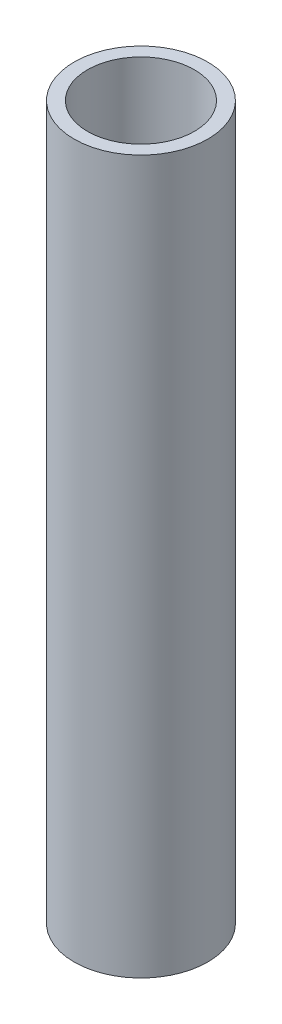
ISO-10303-21;
HEADER;
FILE_DESCRIPTION(('STEP AP214'),'2;1');
FILE_NAME('part.step','',(''),(''),'','','');
FILE_SCHEMA(('AUTOMOTIVE_DESIGN { 1 0 10303 214 1 1 1 1 }'));
ENDSEC;
DATA;
#1=APPLICATION_CONTEXT('core data for automotive mechanical design processes');
#2=APPLICATION_PROTOCOL_DEFINITION('international standard','automotive_design',2000,#1);
#3=PRODUCT_CONTEXT('',#1,'mechanical');
#4=PRODUCT('Part','Part','',(#3));
#5=PRODUCT_RELATED_PRODUCT_CATEGORY('part','',(#4));
#6=PRODUCT_DEFINITION_FORMATION('','',#4);
#7=PRODUCT_DEFINITION_CONTEXT('part definition',#1,'design');
#8=PRODUCT_DEFINITION('design','',#6,#7);
#9=PRODUCT_DEFINITION_SHAPE('','',#8);
#10=(LENGTH_UNIT() NAMED_UNIT(*) SI_UNIT(.MILLI.,.METRE.));
#11=(NAMED_UNIT(*) PLANE_ANGLE_UNIT() SI_UNIT($,.RADIAN.));
#12=(NAMED_UNIT(*) SI_UNIT($,.STERADIAN.) SOLID_ANGLE_UNIT());
#13=UNCERTAINTY_MEASURE_WITH_UNIT(LENGTH_MEASURE(1.E-05),#10,'distance_accuracy_value','');
#14=(GEOMETRIC_REPRESENTATION_CONTEXT(3) GLOBAL_UNCERTAINTY_ASSIGNED_CONTEXT((#13)) GLOBAL_UNIT_ASSIGNED_CONTEXT((#10,
#11,#12)) REPRESENTATION_CONTEXT('',''));
#15=CARTESIAN_POINT('',(0.,0.,0.));
#16=DIRECTION('',(0.,0.,1.));
#17=DIRECTION('',(1.,0.,0.));
#18=AXIS2_PLACEMENT_3D('',#15,#16,#17);
#19=CARTESIAN_POINT('',(0.,50.8,0.));
#20=DIRECTION('',(0.,1.,0.));
#21=DIRECTION('',(0.,0.,1.));
#22=AXIS2_PLACEMENT_3D('',#19,#20,#21);
#23=PLANE('',#22);
#24=CARTESIAN_POINT('',(0.,50.8,0.));
#25=DIRECTION('',(0.,1.,0.));
#26=DIRECTION('',(0.,0.,1.));
#27=AXIS2_PLACEMENT_3D('',#24,#25,#26);
#28=CIRCLE('',#27,4.7625);
#29=CARTESIAN_POINT('',(0.,50.8,4.7625));
#30=VERTEX_POINT('',#29);
#31=EDGE_CURVE('E10',#30,#30,#28,.T.);
#32=ORIENTED_EDGE('',*,*,#31,.T.);
#33=EDGE_LOOP('',(#32));
#34=FACE_BOUND('',#33,.T.);
#35=CARTESIAN_POINT('',(0.,50.8,0.));
#36=DIRECTION('',(0.,1.,0.));
#37=DIRECTION('',(0.,0.,1.));
#38=AXIS2_PLACEMENT_3D('',#35,#36,#37);
#39=CIRCLE('',#38,3.81);
#40=CARTESIAN_POINT('',(0.,50.8,3.81));
#41=VERTEX_POINT('',#40);
#42=EDGE_CURVE('E42',#41,#41,#39,.T.);
#43=ORIENTED_EDGE('',*,*,#42,.F.);
#44=EDGE_LOOP('',(#43));
#45=FACE_BOUND('',#44,.T.);
#46=ADVANCED_FACE('F31',(#34,#45),#23,.T.);
#47=CARTESIAN_POINT('',(0.,0.,0.));
#48=DIRECTION('',(0.,1.,0.));
#49=DIRECTION('',(0.,0.,1.));
#50=AXIS2_PLACEMENT_3D('',#47,#48,#49);
#51=PLANE('',#50);
#52=CARTESIAN_POINT('',(0.,0.,0.));
#53=DIRECTION('',(0.,1.,0.));
#54=DIRECTION('',(0.,0.,1.));
#55=AXIS2_PLACEMENT_3D('',#52,#53,#54);
#56=CIRCLE('',#55,4.7625);
#57=CARTESIAN_POINT('',(0.,0.,4.7625));
#58=VERTEX_POINT('',#57);
#59=EDGE_CURVE('E35',#58,#58,#56,.T.);
#60=ORIENTED_EDGE('',*,*,#59,.F.);
#61=EDGE_LOOP('',(#60));
#62=FACE_BOUND('',#61,.T.);
#63=CARTESIAN_POINT('',(0.,0.,0.));
#64=DIRECTION('',(0.,1.,0.));
#65=DIRECTION('',(0.,0.,1.));
#66=AXIS2_PLACEMENT_3D('',#63,#64,#65);
#67=CIRCLE('',#66,3.81);
#68=CARTESIAN_POINT('',(0.,0.,3.81));
#69=VERTEX_POINT('',#68);
#70=EDGE_CURVE('E44',#69,#69,#67,.T.);
#71=ORIENTED_EDGE('',*,*,#70,.T.);
#72=EDGE_LOOP('',(#71));
#73=FACE_BOUND('',#72,.T.);
#74=ADVANCED_FACE('F54',(#62,#73),#51,.F.);
#75=CARTESIAN_POINT('',(0.,50.8,0.));
#76=DIRECTION('',(0.,-1.,0.));
#77=DIRECTION('',(0.,0.,-1.));
#78=AXIS2_PLACEMENT_3D('',#75,#76,#77);
#79=CYLINDRICAL_SURFACE('',#78,4.7625);
#80=ORIENTED_EDGE('',*,*,#31,.F.);
#81=EDGE_LOOP('',(#80));
#82=FACE_BOUND('',#81,.T.);
#83=ORIENTED_EDGE('',*,*,#59,.T.);
#84=EDGE_LOOP('',(#83));
#85=FACE_BOUND('',#84,.T.);
#86=ADVANCED_FACE('F33',(#82,#85),#79,.T.);
#87=CARTESIAN_POINT('',(0.,50.8,0.));
#88=DIRECTION('',(0.,-1.,0.));
#89=DIRECTION('',(0.,0.,-1.));
#90=AXIS2_PLACEMENT_3D('',#87,#88,#89);
#91=CYLINDRICAL_SURFACE('',#90,3.81);
#92=ORIENTED_EDGE('',*,*,#42,.T.);
#93=EDGE_LOOP('',(#92));
#94=FACE_BOUND('',#93,.T.);
#95=ORIENTED_EDGE('',*,*,#70,.F.);
#96=EDGE_LOOP('',(#95));
#97=FACE_BOUND('',#96,.T.);
#98=ADVANCED_FACE('F50',(#94,#97),#91,.F.);
#99=CLOSED_SHELL('',(#46,#74,#86,#98));
#100=MANIFOLD_SOLID_BREP('B2',#99);
#101=ADVANCED_BREP_SHAPE_REPRESENTATION('',(#18,#100),#14);
#102=SHAPE_DEFINITION_REPRESENTATION(#9,#101);
ENDSEC;
END-ISO-10303-21;
